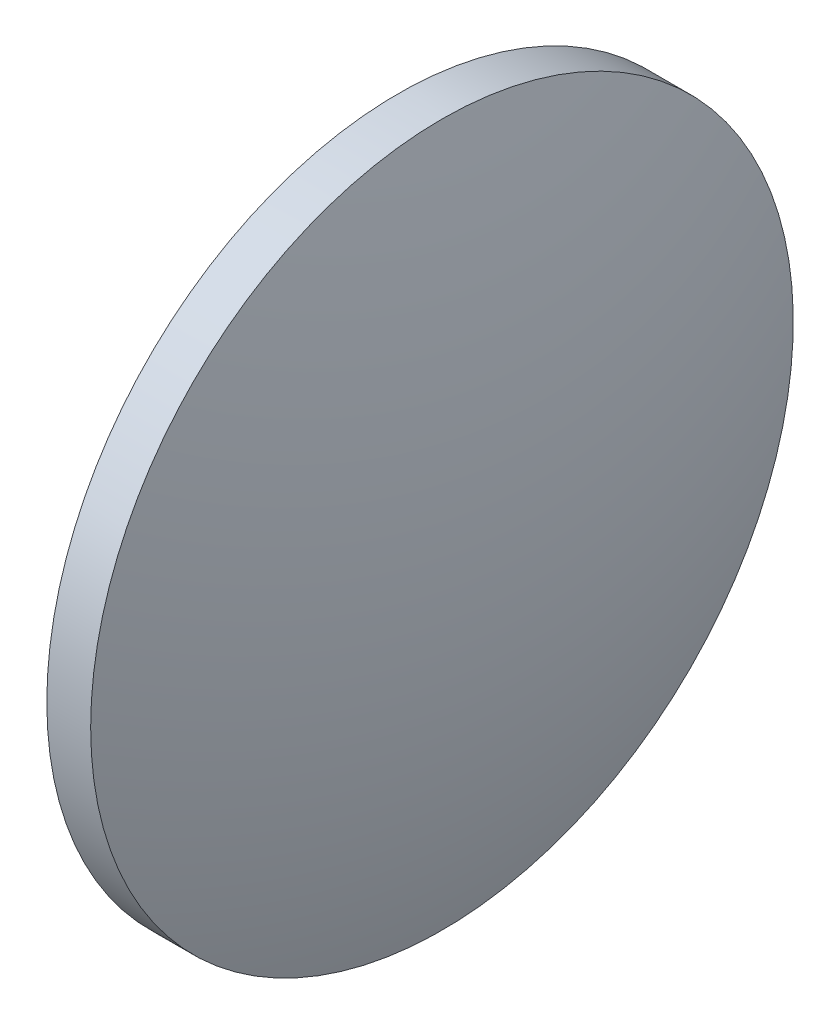
ISO-10303-21;
HEADER;
FILE_DESCRIPTION(('STEP AP214'),'2;1');
FILE_NAME('part.step','',(''),(''),'','','');
FILE_SCHEMA(('AUTOMOTIVE_DESIGN { 1 0 10303 214 1 1 1 1 }'));
ENDSEC;
DATA;
#1=APPLICATION_CONTEXT('core data for automotive mechanical design processes');
#2=APPLICATION_PROTOCOL_DEFINITION('international standard','automotive_design',2000,#1);
#3=PRODUCT_CONTEXT('',#1,'mechanical');
#4=PRODUCT('Part','Part','',(#3));
#5=PRODUCT_RELATED_PRODUCT_CATEGORY('part','',(#4));
#6=PRODUCT_DEFINITION_FORMATION('','',#4);
#7=PRODUCT_DEFINITION_CONTEXT('part definition',#1,'design');
#8=PRODUCT_DEFINITION('design','',#6,#7);
#9=PRODUCT_DEFINITION_SHAPE('','',#8);
#10=(LENGTH_UNIT() NAMED_UNIT(*) SI_UNIT(.MILLI.,.METRE.));
#11=(NAMED_UNIT(*) PLANE_ANGLE_UNIT() SI_UNIT($,.RADIAN.));
#12=(NAMED_UNIT(*) SI_UNIT($,.STERADIAN.) SOLID_ANGLE_UNIT());
#13=UNCERTAINTY_MEASURE_WITH_UNIT(LENGTH_MEASURE(1.E-05),#10,'distance_accuracy_value','');
#14=(GEOMETRIC_REPRESENTATION_CONTEXT(3) GLOBAL_UNCERTAINTY_ASSIGNED_CONTEXT((#13)) GLOBAL_UNIT_ASSIGNED_CONTEXT((#10,
#11,#12)) REPRESENTATION_CONTEXT('',''));
#15=CARTESIAN_POINT('',(0.,0.,0.));
#16=DIRECTION('',(0.,0.,1.));
#17=DIRECTION('',(1.,0.,0.));
#18=AXIS2_PLACEMENT_3D('',#15,#16,#17);
#19=CARTESIAN_POINT('',(446.929823595003,32.3107515396716,0.));
#20=DIRECTION('',(-1.,0.,0.));
#21=DIRECTION('',(0.,1.,0.));
#22=AXIS2_PLACEMENT_3D('',#19,#20,#21);
#23=SPHERICAL_SURFACE('',#22,39.316568627451);
#24=CARTESIAN_POINT('',(484.206392222454,32.3107515396716,0.));
#25=DIRECTION('',(-1.,0.,0.));
#26=DIRECTION('',(0.,0.,1.));
#27=AXIS2_PLACEMENT_3D('',#24,#25,#26);
#28=CIRCLE('',#27,12.5);
#29=CARTESIAN_POINT('',(484.206392222454,32.3107515396716,12.5));
#30=VERTEX_POINT('',#29);
#31=EDGE_CURVE('E10',#30,#30,#28,.T.);
#32=ORIENTED_EDGE('',*,*,#31,.F.);
#33=EDGE_LOOP('',(#32));
#34=FACE_BOUND('',#33,.T.);
#35=ADVANCED_FACE('F35',(#34),#23,.T.);
#36=CARTESIAN_POINT('',(480.617284644017,32.3107515396716,0.));
#37=DIRECTION('',(-1.,0.,0.));
#38=DIRECTION('',(0.,0.,1.));
#39=AXIS2_PLACEMENT_3D('',#36,#37,#38);
#40=CYLINDRICAL_SURFACE('',#39,12.5);
#41=CARTESIAN_POINT('',(482.646392222454,32.3107515396716,0.));
#42=DIRECTION('',(-1.,0.,0.));
#43=DIRECTION('',(0.,0.,1.));
#44=AXIS2_PLACEMENT_3D('',#41,#42,#43);
#45=CIRCLE('',#44,12.5);
#46=CARTESIAN_POINT('',(482.646392222454,32.3107515396716,12.5));
#47=VERTEX_POINT('',#46);
#48=EDGE_CURVE('E41',#47,#47,#45,.T.);
#49=ORIENTED_EDGE('',*,*,#48,.F.);
#50=EDGE_LOOP('',(#49));
#51=FACE_BOUND('',#50,.T.);
#52=ORIENTED_EDGE('',*,*,#31,.T.);
#53=EDGE_LOOP('',(#52));
#54=FACE_BOUND('',#53,.T.);
#55=ADVANCED_FACE('F49',(#51,#54),#40,.T.);
#56=CARTESIAN_POINT('',(482.646392222454,32.3107515396716,0.));
#57=DIRECTION('',(1.,0.,0.));
#58=DIRECTION('',(0.,0.,-1.));
#59=AXIS2_PLACEMENT_3D('',#56,#57,#58);
#60=PLANE('',#59);
#61=ORIENTED_EDGE('',*,*,#48,.T.);
#62=EDGE_LOOP('',(#61));
#63=FACE_BOUND('',#62,.T.);
#64=ADVANCED_FACE('F47',(#63),#60,.F.);
#65=CLOSED_SHELL('',(#35,#55,#64));
#66=MANIFOLD_SOLID_BREP('B2',#65);
#67=ADVANCED_BREP_SHAPE_REPRESENTATION('',(#18,#66),#14);
#68=SHAPE_DEFINITION_REPRESENTATION(#9,#67);
ENDSEC;
END-ISO-10303-21;
